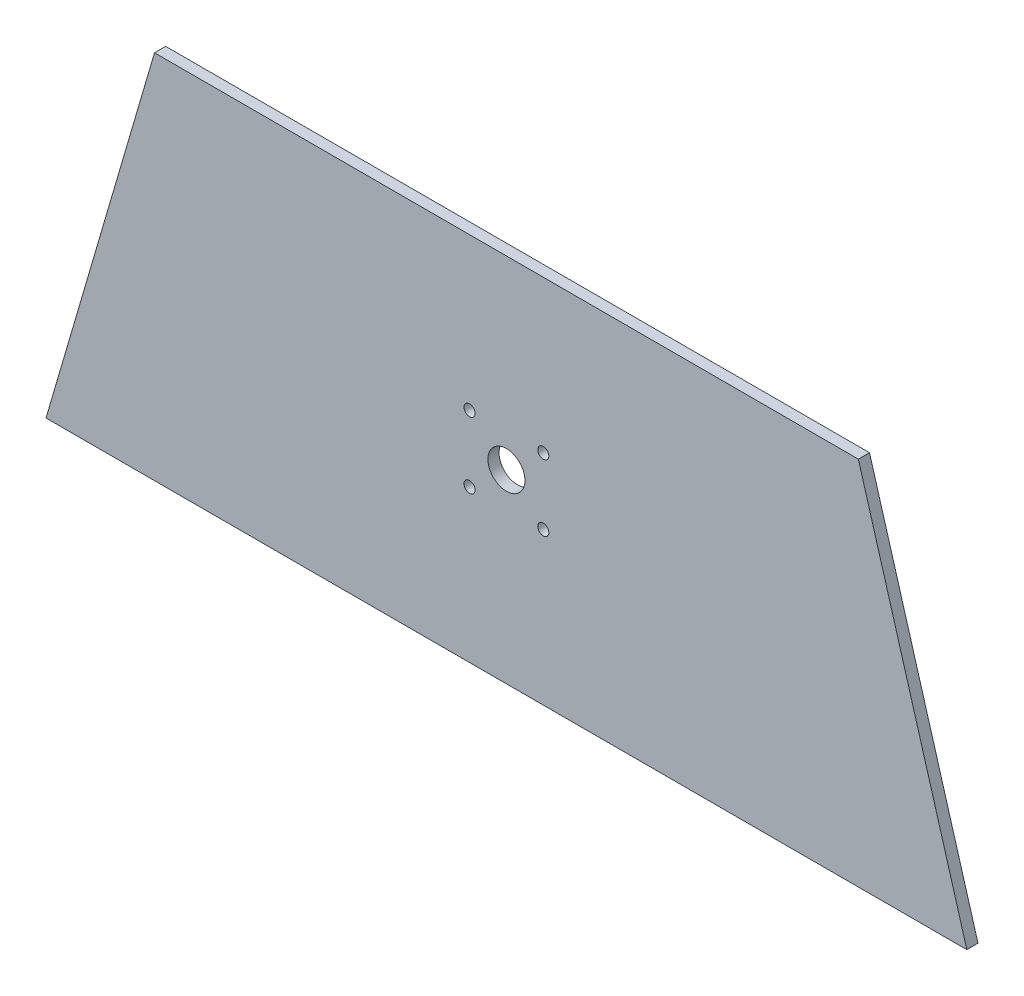
ISO-10303-21;
HEADER;
FILE_DESCRIPTION(('STEP AP214'),'2;1');
FILE_NAME('part.step','',(''),(''),'','','');
FILE_SCHEMA(('AUTOMOTIVE_DESIGN { 1 0 10303 214 1 1 1 1 }'));
ENDSEC;
DATA;
#1=APPLICATION_CONTEXT('core data for automotive mechanical design processes');
#2=APPLICATION_PROTOCOL_DEFINITION('international standard','automotive_design',2000,#1);
#3=PRODUCT_CONTEXT('',#1,'mechanical');
#4=PRODUCT('Part','Part','',(#3));
#5=PRODUCT_RELATED_PRODUCT_CATEGORY('part','',(#4));
#6=PRODUCT_DEFINITION_FORMATION('','',#4);
#7=PRODUCT_DEFINITION_CONTEXT('part definition',#1,'design');
#8=PRODUCT_DEFINITION('design','',#6,#7);
#9=PRODUCT_DEFINITION_SHAPE('','',#8);
#10=(LENGTH_UNIT() NAMED_UNIT(*) SI_UNIT(.MILLI.,.METRE.));
#11=(NAMED_UNIT(*) PLANE_ANGLE_UNIT() SI_UNIT($,.RADIAN.));
#12=(NAMED_UNIT(*) SI_UNIT($,.STERADIAN.) SOLID_ANGLE_UNIT());
#13=UNCERTAINTY_MEASURE_WITH_UNIT(LENGTH_MEASURE(1.E-05),#10,'distance_accuracy_value','');
#14=(GEOMETRIC_REPRESENTATION_CONTEXT(3) GLOBAL_UNCERTAINTY_ASSIGNED_CONTEXT((#13)) GLOBAL_UNIT_ASSIGNED_CONTEXT((#10,
#11,#12)) REPRESENTATION_CONTEXT('',''));
#15=CARTESIAN_POINT('',(0.,0.,0.));
#16=DIRECTION('',(0.,0.,1.));
#17=DIRECTION('',(1.,0.,0.));
#18=AXIS2_PLACEMENT_3D('',#15,#16,#17);
#19=CARTESIAN_POINT('',(-3.5,0.,-0.00672590415549458));
#20=DIRECTION('',(-0.959707262339068,0.281001727065248,0.));
#21=DIRECTION('',(-0.281001727065248,-0.959707262339068,0.));
#22=AXIS2_PLACEMENT_3D('',#19,#20,#21);
#23=PLANE('',#22);
#24=DIRECTION('',(0.,0.,1.));
#25=VECTOR('',#24,1.);
#26=CARTESIAN_POINT('',(-3.5,0.,-0.00672590415549458));
#27=LINE('',#26,#25);
#28=CARTESIAN_POINT('',(-3.5,0.,-0.00672590415549458));
#29=VERTEX_POINT('',#28);
#30=CARTESIAN_POINT('',(-3.5,0.,3.));
#31=VERTEX_POINT('',#30);
#32=EDGE_CURVE('E41',#29,#31,#27,.T.);
#33=ORIENTED_EDGE('',*,*,#32,.T.);
#34=DIRECTION('',(-0.281001727065247,-0.959707262339068,0.));
#35=VECTOR('',#34,1.);
#36=CARTESIAN_POINT('',(-3.5,0.,3.));
#37=LINE('',#36,#35);
#38=CARTESIAN_POINT('',(25.7799417168491,100.,3.));
#39=VERTEX_POINT('',#38);
#40=EDGE_CURVE('E78',#39,#31,#37,.T.);
#41=ORIENTED_EDGE('',*,*,#40,.F.);
#42=DIRECTION('',(0.,0.,1.));
#43=VECTOR('',#42,1.);
#44=CARTESIAN_POINT('',(25.7799417168491,100.,-0.00672590415549458));
#45=LINE('',#44,#43);
#46=CARTESIAN_POINT('',(25.7799417168491,100.,-0.00672590415549458));
#47=VERTEX_POINT('',#46);
#48=EDGE_CURVE('E11',#47,#39,#45,.T.);
#49=ORIENTED_EDGE('',*,*,#48,.F.);
#50=DIRECTION('',(-0.281001727065247,-0.959707262339068,0.));
#51=VECTOR('',#50,1.);
#52=CARTESIAN_POINT('',(-3.5,0.,-0.00672590415549458));
#53=LINE('',#52,#51);
#54=EDGE_CURVE('E79',#47,#29,#53,.T.);
#55=ORIENTED_EDGE('',*,*,#54,.T.);
#56=EDGE_LOOP('',(#33,#41,#49,#55));
#57=FACE_BOUND('',#56,.T.);
#58=ADVANCED_FACE('F38',(#57),#23,.T.);
#59=CARTESIAN_POINT('',(25.7799417168491,100.,-0.00672590415549458));
#60=DIRECTION('',(0.,1.,0.));
#61=DIRECTION('',(0.,0.,1.));
#62=AXIS2_PLACEMENT_3D('',#59,#60,#61);
#63=PLANE('',#62);
#64=ORIENTED_EDGE('',*,*,#48,.T.);
#65=DIRECTION('',(-1.,0.,0.));
#66=VECTOR('',#65,1.);
#67=CARTESIAN_POINT('',(25.7799417168491,100.,3.));
#68=LINE('',#67,#66);
#69=CARTESIAN_POINT('',(215.72005828315,100.,3.));
#70=VERTEX_POINT('',#69);
#71=EDGE_CURVE('E95',#70,#39,#68,.T.);
#72=ORIENTED_EDGE('',*,*,#71,.F.);
#73=DIRECTION('',(0.,0.,1.));
#74=VECTOR('',#73,1.);
#75=CARTESIAN_POINT('',(215.72005828315,100.,-0.00672590415549458));
#76=LINE('',#75,#74);
#77=CARTESIAN_POINT('',(215.72005828315,100.,-0.00672590415549458));
#78=VERTEX_POINT('',#77);
#79=EDGE_CURVE('E46',#78,#70,#76,.T.);
#80=ORIENTED_EDGE('',*,*,#79,.F.);
#81=DIRECTION('',(-1.,0.,0.));
#82=VECTOR('',#81,1.);
#83=CARTESIAN_POINT('',(25.7799417168491,100.,-0.00672590415549458));
#84=LINE('',#83,#82);
#85=EDGE_CURVE('E84',#78,#47,#84,.T.);
#86=ORIENTED_EDGE('',*,*,#85,.T.);
#87=EDGE_LOOP('',(#64,#72,#80,#86));
#88=FACE_BOUND('',#87,.T.);
#89=ADVANCED_FACE('F115',(#88),#63,.T.);
#90=CARTESIAN_POINT('',(245.,0.,-0.00672590415549458));
#91=DIRECTION('',(0.959707262339066,0.281001727065255,0.));
#92=DIRECTION('',(-0.281001727065255,0.959707262339066,0.));
#93=AXIS2_PLACEMENT_3D('',#90,#91,#92);
#94=PLANE('',#93);
#95=ORIENTED_EDGE('',*,*,#79,.T.);
#96=DIRECTION('',(-0.281001727065255,0.959707262339066,0.));
#97=VECTOR('',#96,1.);
#98=CARTESIAN_POINT('',(245.,0.,3.));
#99=LINE('',#98,#97);
#100=CARTESIAN_POINT('',(245.,0.,3.));
#101=VERTEX_POINT('',#100);
#102=EDGE_CURVE('E91',#101,#70,#99,.T.);
#103=ORIENTED_EDGE('',*,*,#102,.F.);
#104=DIRECTION('',(0.,0.,1.));
#105=VECTOR('',#104,1.);
#106=CARTESIAN_POINT('',(245.,0.,-0.00672590415549458));
#107=LINE('',#106,#105);
#108=CARTESIAN_POINT('',(245.,0.,-0.00672590415549458));
#109=VERTEX_POINT('',#108);
#110=EDGE_CURVE('E83',#109,#101,#107,.T.);
#111=ORIENTED_EDGE('',*,*,#110,.F.);
#112=DIRECTION('',(-0.281001727065255,0.959707262339066,0.));
#113=VECTOR('',#112,1.);
#114=CARTESIAN_POINT('',(245.,0.,-0.00672590415549458));
#115=LINE('',#114,#113);
#116=EDGE_CURVE('E108',#109,#78,#115,.T.);
#117=ORIENTED_EDGE('',*,*,#116,.T.);
#118=EDGE_LOOP('',(#95,#103,#111,#117));
#119=FACE_BOUND('',#118,.T.);
#120=ADVANCED_FACE('F112',(#119),#94,.T.);
#121=CARTESIAN_POINT('',(-3.5,0.,-0.00672590415549458));
#122=DIRECTION('',(0.,-1.,0.));
#123=DIRECTION('',(0.,0.,-1.));
#124=AXIS2_PLACEMENT_3D('',#121,#122,#123);
#125=PLANE('',#124);
#126=ORIENTED_EDGE('',*,*,#110,.T.);
#127=DIRECTION('',(1.,0.,0.));
#128=VECTOR('',#127,1.);
#129=CARTESIAN_POINT('',(-3.5,0.,3.));
#130=LINE('',#129,#128);
#131=EDGE_CURVE('E86',#31,#101,#130,.T.);
#132=ORIENTED_EDGE('',*,*,#131,.F.);
#133=ORIENTED_EDGE('',*,*,#32,.F.);
#134=DIRECTION('',(1.,0.,0.));
#135=VECTOR('',#134,1.);
#136=CARTESIAN_POINT('',(-3.5,0.,-0.00672590415549458));
#137=LINE('',#136,#135);
#138=EDGE_CURVE('E106',#29,#109,#137,.T.);
#139=ORIENTED_EDGE('',*,*,#138,.T.);
#140=EDGE_LOOP('',(#126,#132,#133,#139));
#141=FACE_BOUND('',#140,.T.);
#142=ADVANCED_FACE('F87',(#141),#125,.T.);
#143=CARTESIAN_POINT('',(0.,0.,-0.00672590415549458));
#144=DIRECTION('',(0.,0.,-1.));
#145=DIRECTION('',(-1.,0.,0.));
#146=AXIS2_PLACEMENT_3D('',#143,#144,#145);
#147=PLANE('',#146);
#148=CARTESIAN_POINT('',(110.8,58.9500000000001,-0.00672590415549436));
#149=DIRECTION('',(0.,0.,-1.));
#150=DIRECTION('',(-1.,0.,0.));
#151=AXIS2_PLACEMENT_3D('',#148,#149,#150);
#152=CIRCLE('',#151,1.5);
#153=CARTESIAN_POINT('',(109.3,58.9500000000001,-0.00672590415549436));
#154=VERTEX_POINT('',#153);
#155=EDGE_CURVE('E213',#154,#154,#152,.T.);
#156=ORIENTED_EDGE('',*,*,#155,.F.);
#157=EDGE_LOOP('',(#156));
#158=FACE_BOUND('',#157,.T.);
#159=CARTESIAN_POINT('',(130.7,58.9500000000001,-0.00672590415549436));
#160=DIRECTION('',(0.,0.,-1.));
#161=DIRECTION('',(-1.,0.,0.));
#162=AXIS2_PLACEMENT_3D('',#159,#160,#161);
#163=CIRCLE('',#162,1.5);
#164=CARTESIAN_POINT('',(129.2,58.9500000000001,-0.00672590415549436));
#165=VERTEX_POINT('',#164);
#166=EDGE_CURVE('E217',#165,#165,#163,.T.);
#167=ORIENTED_EDGE('',*,*,#166,.F.);
#168=EDGE_LOOP('',(#167));
#169=FACE_BOUND('',#168,.T.);
#170=CARTESIAN_POINT('',(130.7,41.0500000000001,-0.00672590415549436));
#171=DIRECTION('',(0.,0.,-1.));
#172=DIRECTION('',(-1.,0.,0.));
#173=AXIS2_PLACEMENT_3D('',#170,#171,#172);
#174=CIRCLE('',#173,1.5);
#175=CARTESIAN_POINT('',(129.2,41.0500000000001,-0.00672590415549436));
#176=VERTEX_POINT('',#175);
#177=EDGE_CURVE('E226',#176,#176,#174,.T.);
#178=ORIENTED_EDGE('',*,*,#177,.F.);
#179=EDGE_LOOP('',(#178));
#180=FACE_BOUND('',#179,.T.);
#181=CARTESIAN_POINT('',(110.8,41.0500000000001,-0.00672590415549436));
#182=DIRECTION('',(0.,0.,-1.));
#183=DIRECTION('',(-1.,0.,0.));
#184=AXIS2_PLACEMENT_3D('',#181,#182,#183);
#185=CIRCLE('',#184,1.5);
#186=CARTESIAN_POINT('',(109.3,41.0500000000001,-0.00672590415549436));
#187=VERTEX_POINT('',#186);
#188=EDGE_CURVE('E232',#187,#187,#185,.T.);
#189=ORIENTED_EDGE('',*,*,#188,.F.);
#190=EDGE_LOOP('',(#189));
#191=FACE_BOUND('',#190,.T.);
#192=CARTESIAN_POINT('',(120.75,50.0000000000001,-0.00672590415549436));
#193=DIRECTION('',(0.,0.,-1.));
#194=DIRECTION('',(-1.,0.,0.));
#195=AXIS2_PLACEMENT_3D('',#192,#193,#194);
#196=CIRCLE('',#195,5.);
#197=CARTESIAN_POINT('',(115.75,50.0000000000001,-0.00672590415549436));
#198=VERTEX_POINT('',#197);
#199=EDGE_CURVE('E96',#198,#198,#196,.T.);
#200=ORIENTED_EDGE('',*,*,#199,.F.);
#201=EDGE_LOOP('',(#200));
#202=FACE_BOUND('',#201,.T.);
#203=ORIENTED_EDGE('',*,*,#54,.F.);
#204=ORIENTED_EDGE('',*,*,#85,.F.);
#205=ORIENTED_EDGE('',*,*,#116,.F.);
#206=ORIENTED_EDGE('',*,*,#138,.F.);
#207=EDGE_LOOP('',(#203,#204,#205,#206));
#208=FACE_BOUND('',#207,.T.);
#209=ADVANCED_FACE('F117',(#158,#169,#180,#191,#202,#208),#147,.T.);
#210=CARTESIAN_POINT('',(0.,0.,3.));
#211=DIRECTION('',(0.,0.,-1.));
#212=DIRECTION('',(-1.,0.,0.));
#213=AXIS2_PLACEMENT_3D('',#210,#211,#212);
#214=PLANE('',#213);
#215=CARTESIAN_POINT('',(110.8,58.9500000000001,3.));
#216=DIRECTION('',(0.,0.,1.));
#217=DIRECTION('',(1.,0.,0.));
#218=AXIS2_PLACEMENT_3D('',#215,#216,#217);
#219=CIRCLE('',#218,1.5);
#220=CARTESIAN_POINT('',(112.3,58.9500000000001,3.));
#221=VERTEX_POINT('',#220);
#222=EDGE_CURVE('E211',#221,#221,#219,.T.);
#223=ORIENTED_EDGE('',*,*,#222,.F.);
#224=EDGE_LOOP('',(#223));
#225=FACE_BOUND('',#224,.T.);
#226=CARTESIAN_POINT('',(130.7,58.9500000000001,3.));
#227=DIRECTION('',(0.,0.,1.));
#228=DIRECTION('',(1.,0.,0.));
#229=AXIS2_PLACEMENT_3D('',#226,#227,#228);
#230=CIRCLE('',#229,1.5);
#231=CARTESIAN_POINT('',(132.2,58.9500000000001,3.));
#232=VERTEX_POINT('',#231);
#233=EDGE_CURVE('E214',#232,#232,#230,.T.);
#234=ORIENTED_EDGE('',*,*,#233,.F.);
#235=EDGE_LOOP('',(#234));
#236=FACE_BOUND('',#235,.T.);
#237=CARTESIAN_POINT('',(130.7,41.0500000000001,3.));
#238=DIRECTION('',(0.,0.,1.));
#239=DIRECTION('',(1.,0.,0.));
#240=AXIS2_PLACEMENT_3D('',#237,#238,#239);
#241=CIRCLE('',#240,1.5);
#242=CARTESIAN_POINT('',(132.2,41.0500000000001,3.));
#243=VERTEX_POINT('',#242);
#244=EDGE_CURVE('E223',#243,#243,#241,.T.);
#245=ORIENTED_EDGE('',*,*,#244,.F.);
#246=EDGE_LOOP('',(#245));
#247=FACE_BOUND('',#246,.T.);
#248=CARTESIAN_POINT('',(110.8,41.0500000000001,3.));
#249=DIRECTION('',(0.,0.,1.));
#250=DIRECTION('',(1.,0.,0.));
#251=AXIS2_PLACEMENT_3D('',#248,#249,#250);
#252=CIRCLE('',#251,1.5);
#253=CARTESIAN_POINT('',(112.3,41.0500000000001,3.));
#254=VERTEX_POINT('',#253);
#255=EDGE_CURVE('E229',#254,#254,#252,.T.);
#256=ORIENTED_EDGE('',*,*,#255,.F.);
#257=EDGE_LOOP('',(#256));
#258=FACE_BOUND('',#257,.T.);
#259=CARTESIAN_POINT('',(120.75,50.0000000000001,3.));
#260=DIRECTION('',(0.,0.,1.));
#261=DIRECTION('',(1.,0.,0.));
#262=AXIS2_PLACEMENT_3D('',#259,#260,#261);
#263=CIRCLE('',#262,5.);
#264=CARTESIAN_POINT('',(125.75,50.0000000000001,3.));
#265=VERTEX_POINT('',#264);
#266=EDGE_CURVE('E99',#265,#265,#263,.T.);
#267=ORIENTED_EDGE('',*,*,#266,.F.);
#268=EDGE_LOOP('',(#267));
#269=FACE_BOUND('',#268,.T.);
#270=ORIENTED_EDGE('',*,*,#40,.T.);
#271=ORIENTED_EDGE('',*,*,#131,.T.);
#272=ORIENTED_EDGE('',*,*,#102,.T.);
#273=ORIENTED_EDGE('',*,*,#71,.T.);
#274=EDGE_LOOP('',(#270,#271,#272,#273));
#275=FACE_BOUND('',#274,.T.);
#276=ADVANCED_FACE('F94',(#225,#236,#247,#258,#269,#275),#214,.F.);
#277=CARTESIAN_POINT('',(120.75,50.0000000000001,3.));
#278=DIRECTION('',(0.,0.,1.));
#279=DIRECTION('',(1.,0.,0.));
#280=AXIS2_PLACEMENT_3D('',#277,#278,#279);
#281=CYLINDRICAL_SURFACE('',#280,5.);
#282=ORIENTED_EDGE('',*,*,#266,.T.);
#283=EDGE_LOOP('',(#282));
#284=FACE_BOUND('',#283,.T.);
#285=ORIENTED_EDGE('',*,*,#199,.T.);
#286=EDGE_LOOP('',(#285));
#287=FACE_BOUND('',#286,.T.);
#288=ADVANCED_FACE('F125',(#284,#287),#281,.F.);
#289=CARTESIAN_POINT('',(110.8,41.0500000000001,3.));
#290=DIRECTION('',(0.,0.,1.));
#291=DIRECTION('',(1.,0.,0.));
#292=AXIS2_PLACEMENT_3D('',#289,#290,#291);
#293=CYLINDRICAL_SURFACE('',#292,1.5);
#294=ORIENTED_EDGE('',*,*,#255,.T.);
#295=EDGE_LOOP('',(#294));
#296=FACE_BOUND('',#295,.T.);
#297=ORIENTED_EDGE('',*,*,#188,.T.);
#298=EDGE_LOOP('',(#297));
#299=FACE_BOUND('',#298,.T.);
#300=ADVANCED_FACE('F154',(#296,#299),#293,.F.);
#301=CARTESIAN_POINT('',(130.7,41.0500000000001,3.));
#302=DIRECTION('',(0.,0.,1.));
#303=DIRECTION('',(1.,0.,0.));
#304=AXIS2_PLACEMENT_3D('',#301,#302,#303);
#305=CYLINDRICAL_SURFACE('',#304,1.5);
#306=ORIENTED_EDGE('',*,*,#244,.T.);
#307=EDGE_LOOP('',(#306));
#308=FACE_BOUND('',#307,.T.);
#309=ORIENTED_EDGE('',*,*,#177,.T.);
#310=EDGE_LOOP('',(#309));
#311=FACE_BOUND('',#310,.T.);
#312=ADVANCED_FACE('F174',(#308,#311),#305,.F.);
#313=CARTESIAN_POINT('',(130.7,58.9500000000001,3.));
#314=DIRECTION('',(0.,0.,1.));
#315=DIRECTION('',(1.,0.,0.));
#316=AXIS2_PLACEMENT_3D('',#313,#314,#315);
#317=CYLINDRICAL_SURFACE('',#316,1.5);
#318=ORIENTED_EDGE('',*,*,#233,.T.);
#319=EDGE_LOOP('',(#318));
#320=FACE_BOUND('',#319,.T.);
#321=ORIENTED_EDGE('',*,*,#166,.T.);
#322=EDGE_LOOP('',(#321));
#323=FACE_BOUND('',#322,.T.);
#324=ADVANCED_FACE('F184',(#320,#323),#317,.F.);
#325=CARTESIAN_POINT('',(110.8,58.9500000000001,3.));
#326=DIRECTION('',(0.,0.,1.));
#327=DIRECTION('',(1.,0.,0.));
#328=AXIS2_PLACEMENT_3D('',#325,#326,#327);
#329=CYLINDRICAL_SURFACE('',#328,1.5);
#330=ORIENTED_EDGE('',*,*,#222,.T.);
#331=EDGE_LOOP('',(#330));
#332=FACE_BOUND('',#331,.T.);
#333=ORIENTED_EDGE('',*,*,#155,.T.);
#334=EDGE_LOOP('',(#333));
#335=FACE_BOUND('',#334,.T.);
#336=ADVANCED_FACE('F194',(#332,#335),#329,.F.);
#337=CLOSED_SHELL('',(#58,#89,#120,#142,#209,#276,#288,#300,#312,#324,#336));
#338=MANIFOLD_SOLID_BREP('B2',#337);
#339=ADVANCED_BREP_SHAPE_REPRESENTATION('',(#18,#338),#14);
#340=SHAPE_DEFINITION_REPRESENTATION(#9,#339);
ENDSEC;
END-ISO-10303-21;
